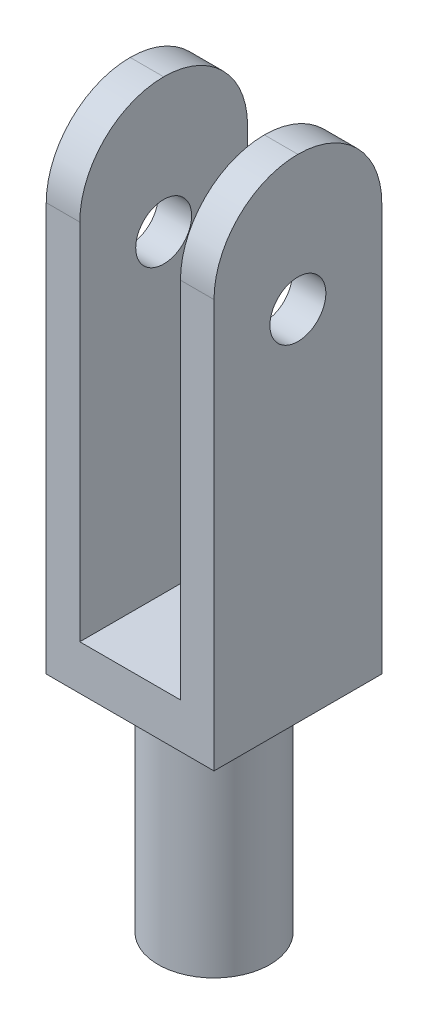
ISO-10303-21;
HEADER;
FILE_DESCRIPTION(('STEP AP214'),'2;1');
FILE_NAME('part.step','',(''),(''),'','','');
FILE_SCHEMA(('AUTOMOTIVE_DESIGN { 1 0 10303 214 1 1 1 1 }'));
ENDSEC;
DATA;
#1=APPLICATION_CONTEXT('core data for automotive mechanical design processes');
#2=APPLICATION_PROTOCOL_DEFINITION('international standard','automotive_design',2000,#1);
#3=PRODUCT_CONTEXT('',#1,'mechanical');
#4=PRODUCT('Part','Part','',(#3));
#5=PRODUCT_RELATED_PRODUCT_CATEGORY('part','',(#4));
#6=PRODUCT_DEFINITION_FORMATION('','',#4);
#7=PRODUCT_DEFINITION_CONTEXT('part definition',#1,'design');
#8=PRODUCT_DEFINITION('design','',#6,#7);
#9=PRODUCT_DEFINITION_SHAPE('','',#8);
#10=(LENGTH_UNIT() NAMED_UNIT(*) SI_UNIT(.MILLI.,.METRE.));
#11=(NAMED_UNIT(*) PLANE_ANGLE_UNIT() SI_UNIT($,.RADIAN.));
#12=(NAMED_UNIT(*) SI_UNIT($,.STERADIAN.) SOLID_ANGLE_UNIT());
#13=UNCERTAINTY_MEASURE_WITH_UNIT(LENGTH_MEASURE(1.E-05),#10,'distance_accuracy_value','');
#14=(GEOMETRIC_REPRESENTATION_CONTEXT(3) GLOBAL_UNCERTAINTY_ASSIGNED_CONTEXT((#13)) GLOBAL_UNIT_ASSIGNED_CONTEXT((#10,
#11,#12)) REPRESENTATION_CONTEXT('',''));
#15=CARTESIAN_POINT('',(0.,0.,0.));
#16=DIRECTION('',(0.,0.,1.));
#17=DIRECTION('',(1.,0.,0.));
#18=AXIS2_PLACEMENT_3D('',#15,#16,#17);
#19=CARTESIAN_POINT('',(0.,5.08,0.));
#20=DIRECTION('',(0.,1.,0.));
#21=DIRECTION('',(0.,0.,1.));
#22=AXIS2_PLACEMENT_3D('',#19,#20,#21);
#23=PLANE('',#22);
#24=DIRECTION('',(1.,0.,0.));
#25=VECTOR('',#24,1.);
#26=CARTESIAN_POINT('',(0.,5.08,19.05));
#27=LINE('',#26,#25);
#28=CARTESIAN_POINT('',(3.81,5.08,19.05));
#29=VERTEX_POINT('',#28);
#30=CARTESIAN_POINT('',(15.24,5.08,19.05));
#31=VERTEX_POINT('',#30);
#32=EDGE_CURVE('E132',#29,#31,#27,.T.);
#33=ORIENTED_EDGE('',*,*,#32,.T.);
#34=DIRECTION('',(0.,0.,1.));
#35=VECTOR('',#34,1.);
#36=CARTESIAN_POINT('',(15.24,5.08,19.05));
#37=LINE('',#36,#35);
#38=CARTESIAN_POINT('',(15.24,5.08,0.));
#39=VERTEX_POINT('',#38);
#40=EDGE_CURVE('E130',#39,#31,#37,.T.);
#41=ORIENTED_EDGE('',*,*,#40,.F.);
#42=DIRECTION('',(-1.,0.,0.));
#43=VECTOR('',#42,1.);
#44=CARTESIAN_POINT('',(0.,5.08,0.));
#45=LINE('',#44,#43);
#46=CARTESIAN_POINT('',(3.81,5.08,0.));
#47=VERTEX_POINT('',#46);
#48=EDGE_CURVE('E116',#39,#47,#45,.T.);
#49=ORIENTED_EDGE('',*,*,#48,.T.);
#50=DIRECTION('',(0.,0.,-1.));
#51=VECTOR('',#50,1.);
#52=CARTESIAN_POINT('',(3.81,5.08,0.));
#53=LINE('',#52,#51);
#54=EDGE_CURVE('E122',#29,#47,#53,.T.);
#55=ORIENTED_EDGE('',*,*,#54,.F.);
#56=EDGE_LOOP('',(#33,#41,#49,#55));
#57=FACE_BOUND('',#56,.T.);
#58=ADVANCED_FACE('F33',(#57),#23,.T.);
#59=CARTESIAN_POINT('',(0.,5.08,0.));
#60=DIRECTION('',(1.,0.,0.));
#61=DIRECTION('',(0.,0.,-1.));
#62=AXIS2_PLACEMENT_3D('',#59,#60,#61);
#63=PLANE('',#62);
#64=CARTESIAN_POINT('',(0.,40.64,9.525));
#65=DIRECTION('',(-1.,0.,0.));
#66=DIRECTION('',(0.,0.,1.));
#67=AXIS2_PLACEMENT_3D('',#64,#65,#66);
#68=CIRCLE('',#67,3.175);
#69=CARTESIAN_POINT('',(0.,40.64,12.7));
#70=VERTEX_POINT('',#69);
#71=EDGE_CURVE('E200',#70,#70,#68,.T.);
#72=ORIENTED_EDGE('',*,*,#71,.F.);
#73=EDGE_LOOP('',(#72));
#74=FACE_BOUND('',#73,.T.);
#75=CARTESIAN_POINT('',(0.,46.355,9.525));
#76=DIRECTION('',(1.,0.,0.));
#77=DIRECTION('',(0.,0.,-1.));
#78=AXIS2_PLACEMENT_3D('',#75,#76,#77);
#79=CIRCLE('',#78,9.525);
#80=CARTESIAN_POINT('',(0.,46.355,19.05));
#81=VERTEX_POINT('',#80);
#82=CARTESIAN_POINT('',(0.,55.88,9.525));
#83=VERTEX_POINT('',#82);
#84=EDGE_CURVE('E163',#81,#83,#79,.F.);
#85=ORIENTED_EDGE('',*,*,#84,.T.);
#86=CARTESIAN_POINT('',(0.,46.355,9.525));
#87=DIRECTION('',(1.,0.,0.));
#88=DIRECTION('',(0.,0.,-1.));
#89=AXIS2_PLACEMENT_3D('',#86,#87,#88);
#90=CIRCLE('',#89,9.525);
#91=CARTESIAN_POINT('',(0.,46.355,0.));
#92=VERTEX_POINT('',#91);
#93=EDGE_CURVE('E165',#83,#92,#90,.F.);
#94=ORIENTED_EDGE('',*,*,#93,.T.);
#95=DIRECTION('',(0.,-1.,0.));
#96=VECTOR('',#95,1.);
#97=CARTESIAN_POINT('',(0.,5.08,0.));
#98=LINE('',#97,#96);
#99=CARTESIAN_POINT('',(0.,0.,0.));
#100=VERTEX_POINT('',#99);
#101=EDGE_CURVE('E131',#92,#100,#98,.T.);
#102=ORIENTED_EDGE('',*,*,#101,.T.);
#103=DIRECTION('',(0.,0.,1.));
#104=VECTOR('',#103,1.);
#105=CARTESIAN_POINT('',(0.,0.,0.));
#106=LINE('',#105,#104);
#107=CARTESIAN_POINT('',(0.,0.,19.05));
#108=VERTEX_POINT('',#107);
#109=EDGE_CURVE('E143',#100,#108,#106,.T.);
#110=ORIENTED_EDGE('',*,*,#109,.T.);
#111=DIRECTION('',(0.,-1.,0.));
#112=VECTOR('',#111,1.);
#113=CARTESIAN_POINT('',(0.,5.08,19.05));
#114=LINE('',#113,#112);
#115=EDGE_CURVE('E161',#81,#108,#114,.T.);
#116=ORIENTED_EDGE('',*,*,#115,.F.);
#117=EDGE_LOOP('',(#85,#94,#102,#110,#116));
#118=FACE_BOUND('',#117,.T.);
#119=ADVANCED_FACE('F224',(#74,#118),#63,.F.);
#120=CARTESIAN_POINT('',(0.,5.08,19.05));
#121=DIRECTION('',(0.,0.,-1.));
#122=DIRECTION('',(-1.,0.,0.));
#123=AXIS2_PLACEMENT_3D('',#120,#121,#122);
#124=PLANE('',#123);
#125=DIRECTION('',(0.,-1.,0.));
#126=VECTOR('',#125,1.);
#127=CARTESIAN_POINT('',(3.81,55.88,19.05));
#128=LINE('',#127,#126);
#129=CARTESIAN_POINT('',(3.81,46.355,19.05));
#130=VERTEX_POINT('',#129);
#131=EDGE_CURVE('E121',#130,#29,#128,.T.);
#132=ORIENTED_EDGE('',*,*,#131,.F.);
#133=DIRECTION('',(1.,0.,0.));
#134=VECTOR('',#133,1.);
#135=CARTESIAN_POINT('',(0.,46.355,19.05));
#136=LINE('',#135,#134);
#137=EDGE_CURVE('E42',#130,#81,#136,.F.);
#138=ORIENTED_EDGE('',*,*,#137,.T.);
#139=ORIENTED_EDGE('',*,*,#115,.T.);
#140=DIRECTION('',(1.,0.,0.));
#141=VECTOR('',#140,1.);
#142=CARTESIAN_POINT('',(0.,0.,19.05));
#143=LINE('',#142,#141);
#144=CARTESIAN_POINT('',(19.05,0.,19.05));
#145=VERTEX_POINT('',#144);
#146=EDGE_CURVE('E148',#108,#145,#143,.T.);
#147=ORIENTED_EDGE('',*,*,#146,.T.);
#148=DIRECTION('',(0.,-1.,0.));
#149=VECTOR('',#148,1.);
#150=CARTESIAN_POINT('',(19.05,5.08,19.05));
#151=LINE('',#150,#149);
#152=CARTESIAN_POINT('',(19.05,46.355,19.05));
#153=VERTEX_POINT('',#152);
#154=EDGE_CURVE('E159',#153,#145,#151,.T.);
#155=ORIENTED_EDGE('',*,*,#154,.F.);
#156=DIRECTION('',(1.,0.,0.));
#157=VECTOR('',#156,1.);
#158=CARTESIAN_POINT('',(15.24,46.355,19.05));
#159=LINE('',#158,#157);
#160=CARTESIAN_POINT('',(15.24,46.355,19.05));
#161=VERTEX_POINT('',#160);
#162=EDGE_CURVE('E181',#153,#161,#159,.F.);
#163=ORIENTED_EDGE('',*,*,#162,.T.);
#164=DIRECTION('',(0.,-1.,0.));
#165=VECTOR('',#164,1.);
#166=CARTESIAN_POINT('',(15.24,55.88,19.05));
#167=LINE('',#166,#165);
#168=EDGE_CURVE('E138',#161,#31,#167,.T.);
#169=ORIENTED_EDGE('',*,*,#168,.T.);
#170=ORIENTED_EDGE('',*,*,#32,.F.);
#171=EDGE_LOOP('',(#132,#138,#139,#147,#155,#163,#169,#170));
#172=FACE_BOUND('',#171,.T.);
#173=ADVANCED_FACE('F204',(#172),#124,.F.);
#174=CARTESIAN_POINT('',(19.05,5.08,0.));
#175=DIRECTION('',(-1.,0.,0.));
#176=DIRECTION('',(0.,0.,1.));
#177=AXIS2_PLACEMENT_3D('',#174,#175,#176);
#178=PLANE('',#177);
#179=CARTESIAN_POINT('',(19.05,40.64,9.525));
#180=DIRECTION('',(-1.,0.,0.));
#181=DIRECTION('',(0.,0.,1.));
#182=AXIS2_PLACEMENT_3D('',#179,#180,#181);
#183=CIRCLE('',#182,3.175);
#184=CARTESIAN_POINT('',(19.05,40.64,12.7));
#185=VERTEX_POINT('',#184);
#186=EDGE_CURVE('E197',#185,#185,#183,.T.);
#187=ORIENTED_EDGE('',*,*,#186,.T.);
#188=EDGE_LOOP('',(#187));
#189=FACE_BOUND('',#188,.T.);
#190=DIRECTION('',(0.,-1.,0.));
#191=VECTOR('',#190,1.);
#192=CARTESIAN_POINT('',(19.05,5.08,0.));
#193=LINE('',#192,#191);
#194=CARTESIAN_POINT('',(19.05,46.355,0.));
#195=VERTEX_POINT('',#194);
#196=CARTESIAN_POINT('',(19.05,0.,0.));
#197=VERTEX_POINT('',#196);
#198=EDGE_CURVE('E157',#195,#197,#193,.T.);
#199=ORIENTED_EDGE('',*,*,#198,.F.);
#200=CARTESIAN_POINT('',(19.05,46.355,9.525));
#201=DIRECTION('',(-1.,0.,0.));
#202=DIRECTION('',(0.,0.,1.));
#203=AXIS2_PLACEMENT_3D('',#200,#201,#202);
#204=CIRCLE('',#203,9.525);
#205=CARTESIAN_POINT('',(19.05,55.88,9.525));
#206=VERTEX_POINT('',#205);
#207=EDGE_CURVE('E55',#195,#206,#204,.F.);
#208=ORIENTED_EDGE('',*,*,#207,.T.);
#209=CARTESIAN_POINT('',(19.05,46.355,9.525));
#210=DIRECTION('',(-1.,0.,0.));
#211=DIRECTION('',(0.,0.,1.));
#212=AXIS2_PLACEMENT_3D('',#209,#210,#211);
#213=CIRCLE('',#212,9.525);
#214=EDGE_CURVE('E50',#206,#153,#213,.F.);
#215=ORIENTED_EDGE('',*,*,#214,.T.);
#216=ORIENTED_EDGE('',*,*,#154,.T.);
#217=DIRECTION('',(0.,0.,-1.));
#218=VECTOR('',#217,1.);
#219=CARTESIAN_POINT('',(19.05,0.,0.));
#220=LINE('',#219,#218);
#221=EDGE_CURVE('E151',#145,#197,#220,.T.);
#222=ORIENTED_EDGE('',*,*,#221,.T.);
#223=EDGE_LOOP('',(#199,#208,#215,#216,#222));
#224=FACE_BOUND('',#223,.T.);
#225=ADVANCED_FACE('F240',(#189,#224),#178,.F.);
#226=CARTESIAN_POINT('',(0.,5.08,0.));
#227=DIRECTION('',(0.,0.,1.));
#228=DIRECTION('',(1.,0.,0.));
#229=AXIS2_PLACEMENT_3D('',#226,#227,#228);
#230=PLANE('',#229);
#231=ORIENTED_EDGE('',*,*,#101,.F.);
#232=DIRECTION('',(-1.,0.,0.));
#233=VECTOR('',#232,1.);
#234=CARTESIAN_POINT('',(3.81,46.355,0.));
#235=LINE('',#234,#233);
#236=CARTESIAN_POINT('',(3.81,46.355,0.));
#237=VERTEX_POINT('',#236);
#238=EDGE_CURVE('E118',#92,#237,#235,.F.);
#239=ORIENTED_EDGE('',*,*,#238,.T.);
#240=DIRECTION('',(0.,-1.,0.));
#241=VECTOR('',#240,1.);
#242=CARTESIAN_POINT('',(3.81,55.88,0.));
#243=LINE('',#242,#241);
#244=EDGE_CURVE('E111',#237,#47,#243,.T.);
#245=ORIENTED_EDGE('',*,*,#244,.T.);
#246=ORIENTED_EDGE('',*,*,#48,.F.);
#247=DIRECTION('',(0.,-1.,0.));
#248=VECTOR('',#247,1.);
#249=CARTESIAN_POINT('',(15.24,55.88,0.));
#250=LINE('',#249,#248);
#251=CARTESIAN_POINT('',(15.24,46.355,0.));
#252=VERTEX_POINT('',#251);
#253=EDGE_CURVE('E136',#252,#39,#250,.T.);
#254=ORIENTED_EDGE('',*,*,#253,.F.);
#255=DIRECTION('',(-1.,0.,0.));
#256=VECTOR('',#255,1.);
#257=CARTESIAN_POINT('',(19.05,46.355,0.));
#258=LINE('',#257,#256);
#259=EDGE_CURVE('E167',#252,#195,#258,.F.);
#260=ORIENTED_EDGE('',*,*,#259,.T.);
#261=ORIENTED_EDGE('',*,*,#198,.T.);
#262=DIRECTION('',(-1.,0.,0.));
#263=VECTOR('',#262,1.);
#264=CARTESIAN_POINT('',(0.,0.,0.));
#265=LINE('',#264,#263);
#266=EDGE_CURVE('E144',#197,#100,#265,.T.);
#267=ORIENTED_EDGE('',*,*,#266,.T.);
#268=EDGE_LOOP('',(#231,#239,#245,#246,#254,#260,#261,#267));
#269=FACE_BOUND('',#268,.T.);
#270=ADVANCED_FACE('F114',(#269),#230,.F.);
#271=CARTESIAN_POINT('',(0.,0.,0.));
#272=DIRECTION('',(0.,1.,0.));
#273=DIRECTION('',(0.,0.,1.));
#274=AXIS2_PLACEMENT_3D('',#271,#272,#273);
#275=PLANE('',#274);
#276=CARTESIAN_POINT('',(9.525,0.,9.525));
#277=DIRECTION('',(0.,-1.,0.));
#278=DIRECTION('',(0.,0.,-1.));
#279=AXIS2_PLACEMENT_3D('',#276,#277,#278);
#280=CIRCLE('',#279,6.35);
#281=CARTESIAN_POINT('',(9.525,0.,3.175));
#282=VERTEX_POINT('',#281);
#283=EDGE_CURVE('E11',#282,#282,#280,.T.);
#284=ORIENTED_EDGE('',*,*,#283,.F.);
#285=EDGE_LOOP('',(#284));
#286=FACE_BOUND('',#285,.T.);
#287=ORIENTED_EDGE('',*,*,#109,.F.);
#288=ORIENTED_EDGE('',*,*,#266,.F.);
#289=ORIENTED_EDGE('',*,*,#221,.F.);
#290=ORIENTED_EDGE('',*,*,#146,.F.);
#291=EDGE_LOOP('',(#287,#288,#289,#290));
#292=FACE_BOUND('',#291,.T.);
#293=ADVANCED_FACE('F234',(#286,#292),#275,.F.);
#294=CARTESIAN_POINT('',(3.81,55.88,0.));
#295=DIRECTION('',(-1.,0.,0.));
#296=DIRECTION('',(0.,0.,1.));
#297=AXIS2_PLACEMENT_3D('',#294,#295,#296);
#298=PLANE('',#297);
#299=CARTESIAN_POINT('',(3.81,40.64,9.525));
#300=DIRECTION('',(-1.,0.,0.));
#301=DIRECTION('',(0.,0.,1.));
#302=AXIS2_PLACEMENT_3D('',#299,#300,#301);
#303=CIRCLE('',#302,3.175);
#304=CARTESIAN_POINT('',(3.81,40.64,12.7));
#305=VERTEX_POINT('',#304);
#306=EDGE_CURVE('E188',#305,#305,#303,.T.);
#307=ORIENTED_EDGE('',*,*,#306,.T.);
#308=EDGE_LOOP('',(#307));
#309=FACE_BOUND('',#308,.T.);
#310=ORIENTED_EDGE('',*,*,#244,.F.);
#311=CARTESIAN_POINT('',(3.81,46.355,9.525));
#312=DIRECTION('',(-1.,0.,0.));
#313=DIRECTION('',(0.,0.,1.));
#314=AXIS2_PLACEMENT_3D('',#311,#312,#313);
#315=CIRCLE('',#314,9.525);
#316=CARTESIAN_POINT('',(3.81,55.88,9.525));
#317=VERTEX_POINT('',#316);
#318=EDGE_CURVE('E173',#237,#317,#315,.F.);
#319=ORIENTED_EDGE('',*,*,#318,.T.);
#320=CARTESIAN_POINT('',(3.81,46.355,9.525));
#321=DIRECTION('',(-1.,0.,0.));
#322=DIRECTION('',(0.,0.,1.));
#323=AXIS2_PLACEMENT_3D('',#320,#321,#322);
#324=CIRCLE('',#323,9.525);
#325=EDGE_CURVE('E171',#317,#130,#324,.F.);
#326=ORIENTED_EDGE('',*,*,#325,.T.);
#327=ORIENTED_EDGE('',*,*,#131,.T.);
#328=ORIENTED_EDGE('',*,*,#54,.T.);
#329=EDGE_LOOP('',(#310,#319,#326,#327,#328));
#330=FACE_BOUND('',#329,.T.);
#331=ADVANCED_FACE('F134',(#309,#330),#298,.F.);
#332=CARTESIAN_POINT('',(15.24,55.88,19.05));
#333=DIRECTION('',(1.,0.,0.));
#334=DIRECTION('',(0.,0.,-1.));
#335=AXIS2_PLACEMENT_3D('',#332,#333,#334);
#336=PLANE('',#335);
#337=CARTESIAN_POINT('',(15.24,40.64,9.525));
#338=DIRECTION('',(1.,0.,0.));
#339=DIRECTION('',(0.,0.,-1.));
#340=AXIS2_PLACEMENT_3D('',#337,#338,#339);
#341=CIRCLE('',#340,3.175);
#342=CARTESIAN_POINT('',(15.24,40.64,6.35));
#343=VERTEX_POINT('',#342);
#344=EDGE_CURVE('E37',#343,#343,#341,.T.);
#345=ORIENTED_EDGE('',*,*,#344,.T.);
#346=EDGE_LOOP('',(#345));
#347=FACE_BOUND('',#346,.T.);
#348=CARTESIAN_POINT('',(15.24,46.355,9.525));
#349=DIRECTION('',(1.,0.,0.));
#350=DIRECTION('',(0.,0.,-1.));
#351=AXIS2_PLACEMENT_3D('',#348,#349,#350);
#352=CIRCLE('',#351,9.525);
#353=CARTESIAN_POINT('',(15.24,55.88,9.525));
#354=VERTEX_POINT('',#353);
#355=EDGE_CURVE('E175',#161,#354,#352,.F.);
#356=ORIENTED_EDGE('',*,*,#355,.T.);
#357=CARTESIAN_POINT('',(15.24,46.355,9.525));
#358=DIRECTION('',(1.,0.,0.));
#359=DIRECTION('',(0.,0.,-1.));
#360=AXIS2_PLACEMENT_3D('',#357,#358,#359);
#361=CIRCLE('',#360,9.525);
#362=EDGE_CURVE('E177',#354,#252,#361,.F.);
#363=ORIENTED_EDGE('',*,*,#362,.T.);
#364=ORIENTED_EDGE('',*,*,#253,.T.);
#365=ORIENTED_EDGE('',*,*,#40,.T.);
#366=ORIENTED_EDGE('',*,*,#168,.F.);
#367=EDGE_LOOP('',(#356,#363,#364,#365,#366));
#368=FACE_BOUND('',#367,.T.);
#369=ADVANCED_FACE('F208',(#347,#368),#336,.F.);
#370=CARTESIAN_POINT('',(0.,46.355,9.525));
#371=DIRECTION('',(-1.,0.,0.));
#372=DIRECTION('',(0.,0.,1.));
#373=AXIS2_PLACEMENT_3D('',#370,#371,#372);
#374=CYLINDRICAL_SURFACE('',#373,9.525);
#375=ORIENTED_EDGE('',*,*,#137,.F.);
#376=ORIENTED_EDGE('',*,*,#325,.F.);
#377=DIRECTION('',(1.,0.,0.));
#378=VECTOR('',#377,1.);
#379=CARTESIAN_POINT('',(3.81,55.88,9.525));
#380=LINE('',#379,#378);
#381=EDGE_CURVE('E184',#83,#317,#380,.T.);
#382=ORIENTED_EDGE('',*,*,#381,.F.);
#383=ORIENTED_EDGE('',*,*,#84,.F.);
#384=EDGE_LOOP('',(#375,#376,#382,#383));
#385=FACE_BOUND('',#384,.T.);
#386=ADVANCED_FACE('F247',(#385),#374,.T.);
#387=CARTESIAN_POINT('',(0.,46.355,9.525));
#388=DIRECTION('',(1.,0.,0.));
#389=DIRECTION('',(0.,0.,-1.));
#390=AXIS2_PLACEMENT_3D('',#387,#388,#389);
#391=CYLINDRICAL_SURFACE('',#390,9.525);
#392=ORIENTED_EDGE('',*,*,#318,.F.);
#393=ORIENTED_EDGE('',*,*,#238,.F.);
#394=ORIENTED_EDGE('',*,*,#93,.F.);
#395=ORIENTED_EDGE('',*,*,#381,.T.);
#396=EDGE_LOOP('',(#392,#393,#394,#395));
#397=FACE_BOUND('',#396,.T.);
#398=ADVANCED_FACE('F220',(#397),#391,.T.);
#399=CARTESIAN_POINT('',(0.,46.355,9.525));
#400=DIRECTION('',(-1.,0.,0.));
#401=DIRECTION('',(0.,0.,1.));
#402=AXIS2_PLACEMENT_3D('',#399,#400,#401);
#403=CYLINDRICAL_SURFACE('',#402,9.525);
#404=ORIENTED_EDGE('',*,*,#162,.F.);
#405=ORIENTED_EDGE('',*,*,#214,.F.);
#406=DIRECTION('',(1.,0.,0.));
#407=VECTOR('',#406,1.);
#408=CARTESIAN_POINT('',(19.05,55.88,9.525));
#409=LINE('',#408,#407);
#410=EDGE_CURVE('E186',#354,#206,#409,.T.);
#411=ORIENTED_EDGE('',*,*,#410,.F.);
#412=ORIENTED_EDGE('',*,*,#355,.F.);
#413=EDGE_LOOP('',(#404,#405,#411,#412));
#414=FACE_BOUND('',#413,.T.);
#415=ADVANCED_FACE('F35',(#414),#403,.T.);
#416=CARTESIAN_POINT('',(0.,46.355,9.525));
#417=DIRECTION('',(1.,0.,0.));
#418=DIRECTION('',(0.,0.,-1.));
#419=AXIS2_PLACEMENT_3D('',#416,#417,#418);
#420=CYLINDRICAL_SURFACE('',#419,9.525);
#421=ORIENTED_EDGE('',*,*,#207,.F.);
#422=ORIENTED_EDGE('',*,*,#259,.F.);
#423=ORIENTED_EDGE('',*,*,#362,.F.);
#424=ORIENTED_EDGE('',*,*,#410,.T.);
#425=EDGE_LOOP('',(#421,#422,#423,#424));
#426=FACE_BOUND('',#425,.T.);
#427=ADVANCED_FACE('F210',(#426),#420,.T.);
#428=CARTESIAN_POINT('',(19.05,40.64,9.525));
#429=DIRECTION('',(-1.,0.,0.));
#430=DIRECTION('',(0.,0.,1.));
#431=AXIS2_PLACEMENT_3D('',#428,#429,#430);
#432=CYLINDRICAL_SURFACE('',#431,3.175);
#433=ORIENTED_EDGE('',*,*,#186,.F.);
#434=EDGE_LOOP('',(#433));
#435=FACE_BOUND('',#434,.T.);
#436=ORIENTED_EDGE('',*,*,#344,.F.);
#437=EDGE_LOOP('',(#436));
#438=FACE_BOUND('',#437,.T.);
#439=ADVANCED_FACE('F212',(#435,#438),#432,.F.);
#440=ORIENTED_EDGE('',*,*,#71,.T.);
#441=EDGE_LOOP('',(#440));
#442=FACE_BOUND('',#441,.T.);
#443=ORIENTED_EDGE('',*,*,#306,.F.);
#444=EDGE_LOOP('',(#443));
#445=FACE_BOUND('',#444,.T.);
#446=ADVANCED_FACE('F217',(#442,#445),#432,.F.);
#447=CARTESIAN_POINT('',(9.525,-25.4,9.525));
#448=DIRECTION('',(0.,1.,0.));
#449=DIRECTION('',(0.,0.,1.));
#450=AXIS2_PLACEMENT_3D('',#447,#448,#449);
#451=CYLINDRICAL_SURFACE('',#450,6.35);
#452=CARTESIAN_POINT('',(9.525,-25.4,9.525));
#453=DIRECTION('',(0.,-1.,0.));
#454=DIRECTION('',(0.,0.,-1.));
#455=AXIS2_PLACEMENT_3D('',#452,#453,#454);
#456=CIRCLE('',#455,6.35);
#457=CARTESIAN_POINT('',(9.525,-25.4,3.175));
#458=VERTEX_POINT('',#457);
#459=EDGE_CURVE('E284',#458,#458,#456,.T.);
#460=ORIENTED_EDGE('',*,*,#459,.F.);
#461=EDGE_LOOP('',(#460));
#462=FACE_BOUND('',#461,.T.);
#463=ORIENTED_EDGE('',*,*,#283,.T.);
#464=EDGE_LOOP('',(#463));
#465=FACE_BOUND('',#464,.T.);
#466=ADVANCED_FACE('F272',(#462,#465),#451,.T.);
#467=CARTESIAN_POINT('',(9.525,-25.4,9.525));
#468=DIRECTION('',(0.,-1.,0.));
#469=DIRECTION('',(0.,0.,-1.));
#470=AXIS2_PLACEMENT_3D('',#467,#468,#469);
#471=PLANE('',#470);
#472=ORIENTED_EDGE('',*,*,#459,.T.);
#473=EDGE_LOOP('',(#472));
#474=FACE_BOUND('',#473,.T.);
#475=ADVANCED_FACE('F276',(#474),#471,.T.);
#476=CLOSED_SHELL('',(#58,#119,#173,#225,#270,#293,#331,#369,#386,#398,#415,#427,#439,#446,#466,#475));
#477=MANIFOLD_SOLID_BREP('B2',#476);
#478=ADVANCED_BREP_SHAPE_REPRESENTATION('',(#18,#477),#14);
#479=SHAPE_DEFINITION_REPRESENTATION(#9,#478);
ENDSEC;
END-ISO-10303-21;
